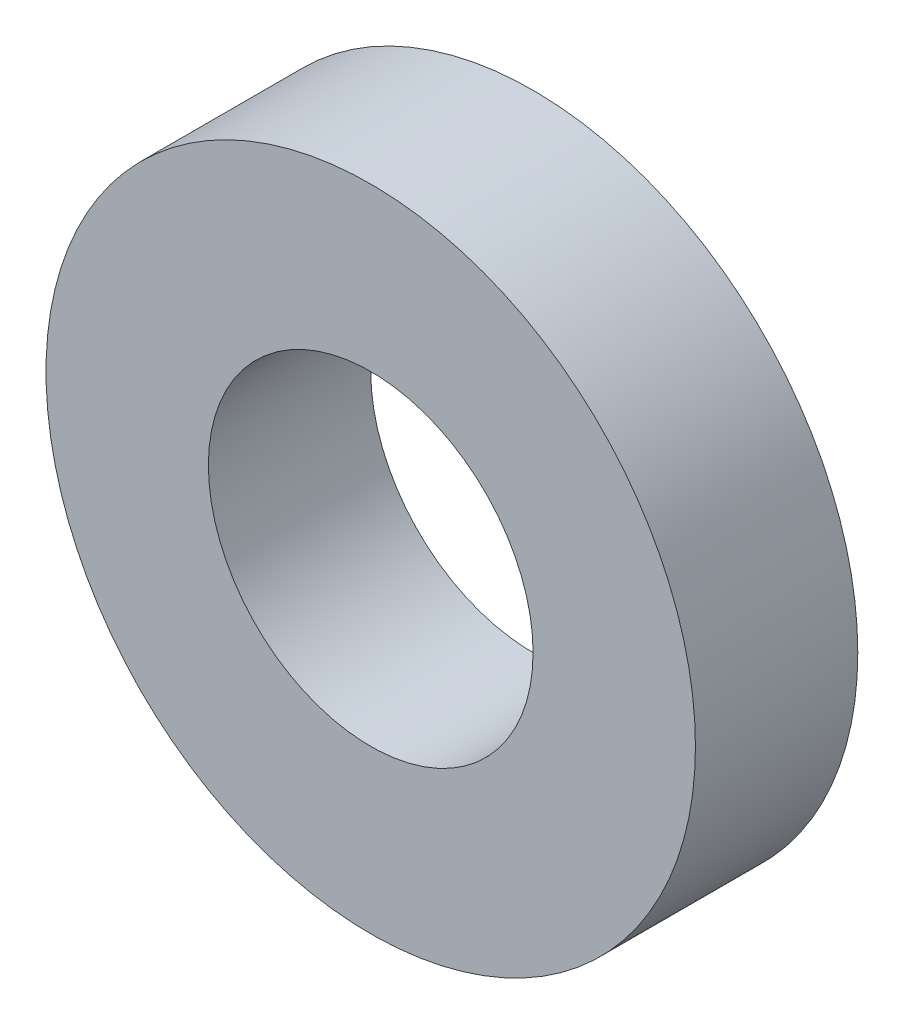
ISO-10303-21;
HEADER;
FILE_DESCRIPTION(('STEP AP214'),'2;1');
FILE_NAME('part.step','',(''),(''),'','','');
FILE_SCHEMA(('AUTOMOTIVE_DESIGN { 1 0 10303 214 1 1 1 1 }'));
ENDSEC;
DATA;
#1=APPLICATION_CONTEXT('core data for automotive mechanical design processes');
#2=APPLICATION_PROTOCOL_DEFINITION('international standard','automotive_design',2000,#1);
#3=PRODUCT_CONTEXT('',#1,'mechanical');
#4=PRODUCT('Part','Part','',(#3));
#5=PRODUCT_RELATED_PRODUCT_CATEGORY('part','',(#4));
#6=PRODUCT_DEFINITION_FORMATION('','',#4);
#7=PRODUCT_DEFINITION_CONTEXT('part definition',#1,'design');
#8=PRODUCT_DEFINITION('design','',#6,#7);
#9=PRODUCT_DEFINITION_SHAPE('','',#8);
#10=(LENGTH_UNIT() NAMED_UNIT(*) SI_UNIT(.MILLI.,.METRE.));
#11=(NAMED_UNIT(*) PLANE_ANGLE_UNIT() SI_UNIT($,.RADIAN.));
#12=(NAMED_UNIT(*) SI_UNIT($,.STERADIAN.) SOLID_ANGLE_UNIT());
#13=UNCERTAINTY_MEASURE_WITH_UNIT(LENGTH_MEASURE(1.E-05),#10,'distance_accuracy_value','');
#14=(GEOMETRIC_REPRESENTATION_CONTEXT(3) GLOBAL_UNCERTAINTY_ASSIGNED_CONTEXT((#13)) GLOBAL_UNIT_ASSIGNED_CONTEXT((#10,
#11,#12)) REPRESENTATION_CONTEXT('',''));
#15=CARTESIAN_POINT('',(0.,0.,0.));
#16=DIRECTION('',(0.,0.,1.));
#17=DIRECTION('',(1.,0.,0.));
#18=AXIS2_PLACEMENT_3D('',#15,#16,#17);
#19=CARTESIAN_POINT('',(0.,0.,0.));
#20=DIRECTION('',(0.,0.,1.));
#21=DIRECTION('',(1.,0.,0.));
#22=AXIS2_PLACEMENT_3D('',#19,#20,#21);
#23=CYLINDRICAL_SURFACE('',#22,0.5);
#24=CARTESIAN_POINT('',(0.,0.,0.));
#25=DIRECTION('',(0.,0.,1.));
#26=DIRECTION('',(1.,0.,0.));
#27=AXIS2_PLACEMENT_3D('',#24,#25,#26);
#28=CIRCLE('',#27,0.5);
#29=CARTESIAN_POINT('',(0.5,0.,0.));
#30=VERTEX_POINT('',#29);
#31=EDGE_CURVE('E45',#30,#30,#28,.T.);
#32=ORIENTED_EDGE('',*,*,#31,.T.);
#33=EDGE_LOOP('',(#32));
#34=FACE_BOUND('',#33,.T.);
#35=CARTESIAN_POINT('',(0.,0.,-0.5));
#36=DIRECTION('',(0.,0.,1.));
#37=DIRECTION('',(1.,0.,0.));
#38=AXIS2_PLACEMENT_3D('',#35,#36,#37);
#39=CIRCLE('',#38,0.5);
#40=CARTESIAN_POINT('',(0.5,0.,-0.5));
#41=VERTEX_POINT('',#40);
#42=EDGE_CURVE('E10',#41,#41,#39,.T.);
#43=ORIENTED_EDGE('',*,*,#42,.F.);
#44=EDGE_LOOP('',(#43));
#45=FACE_BOUND('',#44,.T.);
#46=ADVANCED_FACE('F31',(#34,#45),#23,.F.);
#47=CARTESIAN_POINT('',(0.5,0.,-0.5));
#48=DIRECTION('',(0.,0.,-1.));
#49=DIRECTION('',(-1.,0.,0.));
#50=AXIS2_PLACEMENT_3D('',#47,#48,#49);
#51=PLANE('',#50);
#52=ORIENTED_EDGE('',*,*,#42,.T.);
#53=EDGE_LOOP('',(#52));
#54=FACE_BOUND('',#53,.T.);
#55=CARTESIAN_POINT('',(0.,0.,-0.5));
#56=DIRECTION('',(0.,0.,1.));
#57=DIRECTION('',(1.,0.,0.));
#58=AXIS2_PLACEMENT_3D('',#55,#56,#57);
#59=CIRCLE('',#58,1.);
#60=CARTESIAN_POINT('',(1.,0.,-0.5));
#61=VERTEX_POINT('',#60);
#62=EDGE_CURVE('E37',#61,#61,#59,.T.);
#63=ORIENTED_EDGE('',*,*,#62,.F.);
#64=EDGE_LOOP('',(#63));
#65=FACE_BOUND('',#64,.T.);
#66=ADVANCED_FACE('F61',(#54,#65),#51,.T.);
#67=CARTESIAN_POINT('',(0.,0.,0.));
#68=DIRECTION('',(0.,0.,1.));
#69=DIRECTION('',(1.,0.,0.));
#70=AXIS2_PLACEMENT_3D('',#67,#68,#69);
#71=CYLINDRICAL_SURFACE('',#70,1.);
#72=ORIENTED_EDGE('',*,*,#62,.T.);
#73=EDGE_LOOP('',(#72));
#74=FACE_BOUND('',#73,.T.);
#75=CARTESIAN_POINT('',(0.,0.,0.));
#76=DIRECTION('',(0.,0.,1.));
#77=DIRECTION('',(1.,0.,0.));
#78=AXIS2_PLACEMENT_3D('',#75,#76,#77);
#79=CIRCLE('',#78,1.);
#80=CARTESIAN_POINT('',(1.,0.,0.));
#81=VERTEX_POINT('',#80);
#82=EDGE_CURVE('E41',#81,#81,#79,.T.);
#83=ORIENTED_EDGE('',*,*,#82,.F.);
#84=EDGE_LOOP('',(#83));
#85=FACE_BOUND('',#84,.T.);
#86=ADVANCED_FACE('F55',(#74,#85),#71,.T.);
#87=CARTESIAN_POINT('',(0.5,0.,0.));
#88=DIRECTION('',(0.,0.,1.));
#89=DIRECTION('',(1.,0.,0.));
#90=AXIS2_PLACEMENT_3D('',#87,#88,#89);
#91=PLANE('',#90);
#92=ORIENTED_EDGE('',*,*,#82,.T.);
#93=EDGE_LOOP('',(#92));
#94=FACE_BOUND('',#93,.T.);
#95=ORIENTED_EDGE('',*,*,#31,.F.);
#96=EDGE_LOOP('',(#95));
#97=FACE_BOUND('',#96,.T.);
#98=ADVANCED_FACE('F53',(#94,#97),#91,.T.);
#99=CLOSED_SHELL('',(#46,#66,#86,#98));
#100=MANIFOLD_SOLID_BREP('B2',#99);
#101=ADVANCED_BREP_SHAPE_REPRESENTATION('',(#18,#100),#14);
#102=SHAPE_DEFINITION_REPRESENTATION(#9,#101);
ENDSEC;
END-ISO-10303-21;
